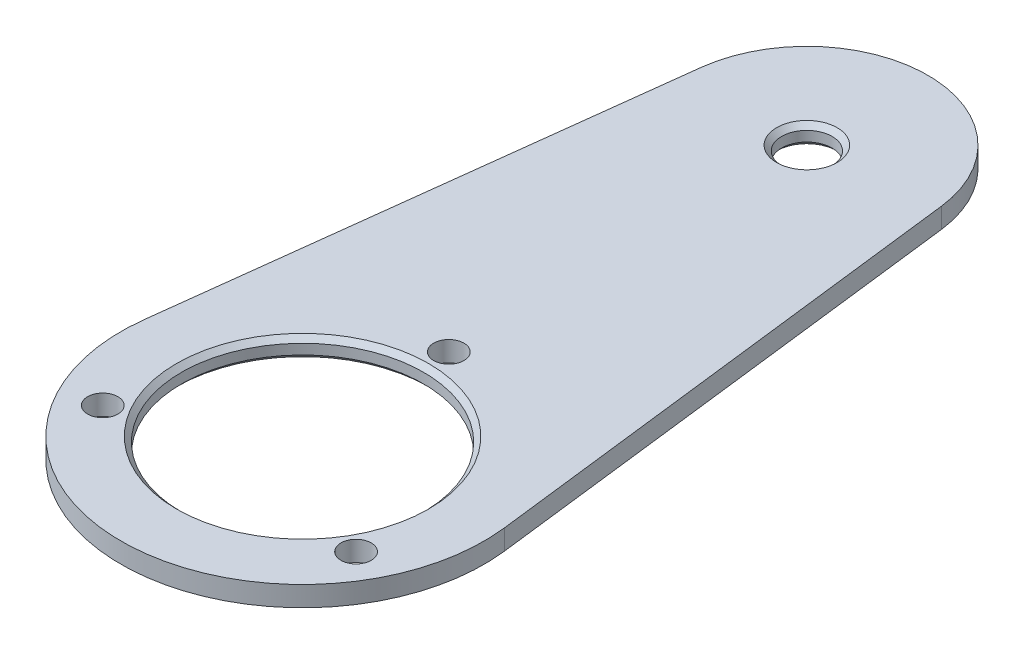
ISO-10303-21;
HEADER;
FILE_DESCRIPTION(('STEP AP214'),'2;1');
FILE_NAME('part.step','',(''),(''),'','','');
FILE_SCHEMA(('AUTOMOTIVE_DESIGN { 1 0 10303 214 1 1 1 1 }'));
ENDSEC;
DATA;
#1=APPLICATION_CONTEXT('core data for automotive mechanical design processes');
#2=APPLICATION_PROTOCOL_DEFINITION('international standard','automotive_design',2000,#1);
#3=PRODUCT_CONTEXT('',#1,'mechanical');
#4=PRODUCT('Part','Part','',(#3));
#5=PRODUCT_RELATED_PRODUCT_CATEGORY('part','',(#4));
#6=PRODUCT_DEFINITION_FORMATION('','',#4);
#7=PRODUCT_DEFINITION_CONTEXT('part definition',#1,'design');
#8=PRODUCT_DEFINITION('design','',#6,#7);
#9=PRODUCT_DEFINITION_SHAPE('','',#8);
#10=(LENGTH_UNIT() NAMED_UNIT(*) SI_UNIT(.MILLI.,.METRE.));
#11=(NAMED_UNIT(*) PLANE_ANGLE_UNIT() SI_UNIT($,.RADIAN.));
#12=(NAMED_UNIT(*) SI_UNIT($,.STERADIAN.) SOLID_ANGLE_UNIT());
#13=UNCERTAINTY_MEASURE_WITH_UNIT(LENGTH_MEASURE(1.E-05),#10,'distance_accuracy_value','');
#14=(GEOMETRIC_REPRESENTATION_CONTEXT(3) GLOBAL_UNCERTAINTY_ASSIGNED_CONTEXT((#13)) GLOBAL_UNIT_ASSIGNED_CONTEXT((#10,
#11,#12)) REPRESENTATION_CONTEXT('',''));
#15=CARTESIAN_POINT('',(0.,0.,0.));
#16=DIRECTION('',(0.,0.,1.));
#17=DIRECTION('',(1.,0.,0.));
#18=AXIS2_PLACEMENT_3D('',#15,#16,#17);
#19=CARTESIAN_POINT('',(0.,2.,0.));
#20=DIRECTION('',(0.,1.,0.));
#21=DIRECTION('',(0.,0.,1.));
#22=AXIS2_PLACEMENT_3D('',#19,#20,#21);
#23=PLANE('',#22);
#24=CARTESIAN_POINT('',(0.,2.,-50.));
#25=DIRECTION('',(0.,1.,0.));
#26=DIRECTION('',(0.,0.,1.));
#27=AXIS2_PLACEMENT_3D('',#24,#25,#26);
#28=CIRCLE('',#27,3.00000000000001);
#29=CARTESIAN_POINT('',(0.,2.,-47.));
#30=VERTEX_POINT('',#29);
#31=EDGE_CURVE('E124',#30,#30,#28,.F.);
#32=ORIENTED_EDGE('',*,*,#31,.T.);
#33=EDGE_LOOP('',(#32));
#34=FACE_BOUND('',#33,.T.);
#35=CARTESIAN_POINT('',(0.,2.,0.));
#36=DIRECTION('',(0.,1.,0.));
#37=DIRECTION('',(0.,0.,1.));
#38=AXIS2_PLACEMENT_3D('',#35,#36,#37);
#39=CIRCLE('',#38,12.5);
#40=CARTESIAN_POINT('',(0.,2.,12.5));
#41=VERTEX_POINT('',#40);
#42=EDGE_CURVE('E121',#41,#41,#39,.F.);
#43=ORIENTED_EDGE('',*,*,#42,.T.);
#44=EDGE_LOOP('',(#43));
#45=FACE_BOUND('',#44,.T.);
#46=CARTESIAN_POINT('',(12.5573683548743,2.,7.25000000000006));
#47=DIRECTION('',(0.,1.,0.));
#48=DIRECTION('',(0.,0.,1.));
#49=AXIS2_PLACEMENT_3D('',#46,#47,#48);
#50=CIRCLE('',#49,1.5);
#51=CARTESIAN_POINT('',(12.5573683548743,2.,8.75000000000006));
#52=VERTEX_POINT('',#51);
#53=EDGE_CURVE('E161',#52,#52,#50,.T.);
#54=ORIENTED_EDGE('',*,*,#53,.F.);
#55=EDGE_LOOP('',(#54));
#56=FACE_BOUND('',#55,.T.);
#57=CARTESIAN_POINT('',(0.,2.,0.));
#58=DIRECTION('',(0.,1.,0.));
#59=DIRECTION('',(0.,0.,1.));
#60=AXIS2_PLACEMENT_3D('',#57,#58,#59);
#61=CIRCLE('',#60,18.);
#62=CARTESIAN_POINT('',(-17.8699300502268,2.,-2.16));
#63=VERTEX_POINT('',#62);
#64=CARTESIAN_POINT('',(17.8699300502268,2.,-2.16));
#65=VERTEX_POINT('',#64);
#66=EDGE_CURVE('E84',#63,#65,#61,.T.);
#67=ORIENTED_EDGE('',*,*,#66,.T.);
#68=DIRECTION('',(-0.12,0.,-0.992773891679268));
#69=VECTOR('',#68,1.);
#70=CARTESIAN_POINT('',(11.9132867001512,2.,-51.44));
#71=LINE('',#70,#69);
#72=CARTESIAN_POINT('',(11.9132867001512,2.,-51.44));
#73=VERTEX_POINT('',#72);
#74=EDGE_CURVE('E79',#65,#73,#71,.T.);
#75=ORIENTED_EDGE('',*,*,#74,.T.);
#76=CARTESIAN_POINT('',(0.,2.,-50.));
#77=DIRECTION('',(0.,1.,0.));
#78=DIRECTION('',(0.,0.,-1.));
#79=AXIS2_PLACEMENT_3D('',#76,#77,#78);
#80=CIRCLE('',#79,12.);
#81=CARTESIAN_POINT('',(-11.9132867001512,2.,-51.44));
#82=VERTEX_POINT('',#81);
#83=EDGE_CURVE('E82',#73,#82,#80,.T.);
#84=ORIENTED_EDGE('',*,*,#83,.T.);
#85=DIRECTION('',(-0.12,0.,0.992773891679269));
#86=VECTOR('',#85,1.);
#87=CARTESIAN_POINT('',(-11.9132867001512,2.,-51.44));
#88=LINE('',#87,#86);
#89=EDGE_CURVE('E48',#82,#63,#88,.T.);
#90=ORIENTED_EDGE('',*,*,#89,.T.);
#91=EDGE_LOOP('',(#67,#75,#84,#90));
#92=FACE_BOUND('',#91,.T.);
#93=CARTESIAN_POINT('',(-12.5573683548744,2.,7.24999999999989));
#94=DIRECTION('',(0.,1.,0.));
#95=DIRECTION('',(0.,0.,1.));
#96=AXIS2_PLACEMENT_3D('',#93,#94,#95);
#97=CIRCLE('',#96,1.5);
#98=CARTESIAN_POINT('',(-12.5573683548744,2.,8.74999999999989));
#99=VERTEX_POINT('',#98);
#100=EDGE_CURVE('E102',#99,#99,#97,.T.);
#101=ORIENTED_EDGE('',*,*,#100,.F.);
#102=EDGE_LOOP('',(#101));
#103=FACE_BOUND('',#102,.T.);
#104=CARTESIAN_POINT('',(0.,2.,-14.5));
#105=DIRECTION('',(0.,1.,0.));
#106=DIRECTION('',(0.,0.,1.));
#107=AXIS2_PLACEMENT_3D('',#104,#105,#106);
#108=CIRCLE('',#107,1.5);
#109=CARTESIAN_POINT('',(0.,2.,-13.));
#110=VERTEX_POINT('',#109);
#111=EDGE_CURVE('E156',#110,#110,#108,.T.);
#112=ORIENTED_EDGE('',*,*,#111,.F.);
#113=EDGE_LOOP('',(#112));
#114=FACE_BOUND('',#113,.T.);
#115=ADVANCED_FACE('F31',(#34,#45,#56,#92,#103,#114),#23,.T.);
#116=CARTESIAN_POINT('',(0.,0.,0.));
#117=DIRECTION('',(0.,1.,0.));
#118=DIRECTION('',(0.,0.,1.));
#119=AXIS2_PLACEMENT_3D('',#116,#117,#118);
#120=PLANE('',#119);
#121=CARTESIAN_POINT('',(0.,0.,-50.));
#122=DIRECTION('',(0.,1.,0.));
#123=DIRECTION('',(0.,0.,1.));
#124=AXIS2_PLACEMENT_3D('',#121,#122,#123);
#125=CIRCLE('',#124,3.00000000000002);
#126=CARTESIAN_POINT('',(0.,0.,-47.));
#127=VERTEX_POINT('',#126);
#128=EDGE_CURVE('E112',#127,#127,#125,.T.);
#129=ORIENTED_EDGE('',*,*,#128,.T.);
#130=EDGE_LOOP('',(#129));
#131=FACE_BOUND('',#130,.T.);
#132=CARTESIAN_POINT('',(0.,0.,0.));
#133=DIRECTION('',(0.,1.,0.));
#134=DIRECTION('',(0.,0.,1.));
#135=AXIS2_PLACEMENT_3D('',#132,#133,#134);
#136=CIRCLE('',#135,12.5);
#137=CARTESIAN_POINT('',(0.,0.,12.5));
#138=VERTEX_POINT('',#137);
#139=EDGE_CURVE('E109',#138,#138,#136,.T.);
#140=ORIENTED_EDGE('',*,*,#139,.T.);
#141=EDGE_LOOP('',(#140));
#142=FACE_BOUND('',#141,.T.);
#143=CARTESIAN_POINT('',(12.5573683548743,0.,7.25000000000006));
#144=DIRECTION('',(0.,1.,0.));
#145=DIRECTION('',(0.,0.,1.));
#146=AXIS2_PLACEMENT_3D('',#143,#144,#145);
#147=CIRCLE('',#146,1.5);
#148=CARTESIAN_POINT('',(12.5573683548743,0.,8.75000000000006));
#149=VERTEX_POINT('',#148);
#150=EDGE_CURVE('E145',#149,#149,#147,.T.);
#151=ORIENTED_EDGE('',*,*,#150,.T.);
#152=EDGE_LOOP('',(#151));
#153=FACE_BOUND('',#152,.T.);
#154=CARTESIAN_POINT('',(0.,0.,0.));
#155=DIRECTION('',(0.,1.,0.));
#156=DIRECTION('',(0.,0.,1.));
#157=AXIS2_PLACEMENT_3D('',#154,#155,#156);
#158=CIRCLE('',#157,18.);
#159=CARTESIAN_POINT('',(-17.8699300502268,0.,-2.16));
#160=VERTEX_POINT('',#159);
#161=CARTESIAN_POINT('',(17.8699300502268,0.,-2.16));
#162=VERTEX_POINT('',#161);
#163=EDGE_CURVE('E99',#160,#162,#158,.T.);
#164=ORIENTED_EDGE('',*,*,#163,.F.);
#165=DIRECTION('',(-0.12,0.,0.992773891679269));
#166=VECTOR('',#165,1.);
#167=CARTESIAN_POINT('',(-11.9132867001512,0.,-51.44));
#168=LINE('',#167,#166);
#169=CARTESIAN_POINT('',(-11.9132867001512,0.,-51.44));
#170=VERTEX_POINT('',#169);
#171=EDGE_CURVE('E71',#170,#160,#168,.T.);
#172=ORIENTED_EDGE('',*,*,#171,.F.);
#173=CARTESIAN_POINT('',(0.,0.,-50.));
#174=DIRECTION('',(0.,1.,0.));
#175=DIRECTION('',(0.,0.,-1.));
#176=AXIS2_PLACEMENT_3D('',#173,#174,#175);
#177=CIRCLE('',#176,12.);
#178=CARTESIAN_POINT('',(11.9132867001512,0.,-51.44));
#179=VERTEX_POINT('',#178);
#180=EDGE_CURVE('E65',#179,#170,#177,.T.);
#181=ORIENTED_EDGE('',*,*,#180,.F.);
#182=DIRECTION('',(-0.12,0.,-0.992773891679268));
#183=VECTOR('',#182,1.);
#184=CARTESIAN_POINT('',(11.9132867001512,0.,-51.44));
#185=LINE('',#184,#183);
#186=EDGE_CURVE('E89',#162,#179,#185,.T.);
#187=ORIENTED_EDGE('',*,*,#186,.F.);
#188=EDGE_LOOP('',(#164,#172,#181,#187));
#189=FACE_BOUND('',#188,.T.);
#190=CARTESIAN_POINT('',(-12.5573683548744,0.,7.24999999999989));
#191=DIRECTION('',(0.,1.,0.));
#192=DIRECTION('',(0.,0.,1.));
#193=AXIS2_PLACEMENT_3D('',#190,#191,#192);
#194=CIRCLE('',#193,1.5);
#195=CARTESIAN_POINT('',(-12.5573683548744,0.,8.74999999999989));
#196=VERTEX_POINT('',#195);
#197=EDGE_CURVE('E151',#196,#196,#194,.T.);
#198=ORIENTED_EDGE('',*,*,#197,.T.);
#199=EDGE_LOOP('',(#198));
#200=FACE_BOUND('',#199,.T.);
#201=CARTESIAN_POINT('',(0.,0.,-14.5));
#202=DIRECTION('',(0.,1.,0.));
#203=DIRECTION('',(0.,0.,1.));
#204=AXIS2_PLACEMENT_3D('',#201,#202,#203);
#205=CIRCLE('',#204,1.5);
#206=CARTESIAN_POINT('',(0.,0.,-13.));
#207=VERTEX_POINT('',#206);
#208=EDGE_CURVE('E154',#207,#207,#205,.T.);
#209=ORIENTED_EDGE('',*,*,#208,.T.);
#210=EDGE_LOOP('',(#209));
#211=FACE_BOUND('',#210,.T.);
#212=ADVANCED_FACE('F136',(#131,#142,#153,#189,#200,#211),#120,.F.);
#213=CARTESIAN_POINT('',(0.,2.,0.));
#214=DIRECTION('',(0.,-1.,0.));
#215=DIRECTION('',(0.,0.,-1.));
#216=AXIS2_PLACEMENT_3D('',#213,#214,#215);
#217=CYLINDRICAL_SURFACE('',#216,18.);
#218=ORIENTED_EDGE('',*,*,#163,.T.);
#219=DIRECTION('',(0.,-1.,0.));
#220=VECTOR('',#219,1.);
#221=CARTESIAN_POINT('',(17.8699300502268,2.,-2.16));
#222=LINE('',#221,#220);
#223=EDGE_CURVE('E90',#65,#162,#222,.T.);
#224=ORIENTED_EDGE('',*,*,#223,.F.);
#225=ORIENTED_EDGE('',*,*,#66,.F.);
#226=DIRECTION('',(0.,-1.,0.));
#227=VECTOR('',#226,1.);
#228=CARTESIAN_POINT('',(-17.8699300502268,2.,-2.16));
#229=LINE('',#228,#227);
#230=EDGE_CURVE('E95',#63,#160,#229,.T.);
#231=ORIENTED_EDGE('',*,*,#230,.T.);
#232=EDGE_LOOP('',(#218,#224,#225,#231));
#233=FACE_BOUND('',#232,.T.);
#234=ADVANCED_FACE('F139',(#233),#217,.T.);
#235=CARTESIAN_POINT('',(11.9132867001512,2.,-51.44));
#236=DIRECTION('',(-0.992773891679269,0.,0.12));
#237=DIRECTION('',(0.12,0.,0.992773891679269));
#238=AXIS2_PLACEMENT_3D('',#235,#236,#237);
#239=PLANE('',#238);
#240=ORIENTED_EDGE('',*,*,#186,.T.);
#241=DIRECTION('',(0.,-1.,0.));
#242=VECTOR('',#241,1.);
#243=CARTESIAN_POINT('',(11.9132867001512,2.,-51.44));
#244=LINE('',#243,#242);
#245=EDGE_CURVE('E87',#73,#179,#244,.T.);
#246=ORIENTED_EDGE('',*,*,#245,.F.);
#247=ORIENTED_EDGE('',*,*,#74,.F.);
#248=ORIENTED_EDGE('',*,*,#223,.T.);
#249=EDGE_LOOP('',(#240,#246,#247,#248));
#250=FACE_BOUND('',#249,.T.);
#251=ADVANCED_FACE('F88',(#250),#239,.F.);
#252=CARTESIAN_POINT('',(0.,2.,-50.));
#253=DIRECTION('',(0.,-1.,0.));
#254=DIRECTION('',(0.,0.,-1.));
#255=AXIS2_PLACEMENT_3D('',#252,#253,#254);
#256=CYLINDRICAL_SURFACE('',#255,12.);
#257=ORIENTED_EDGE('',*,*,#180,.T.);
#258=DIRECTION('',(0.,-1.,0.));
#259=VECTOR('',#258,1.);
#260=CARTESIAN_POINT('',(-11.9132867001512,2.,-51.44));
#261=LINE('',#260,#259);
#262=EDGE_CURVE('E91',#82,#170,#261,.T.);
#263=ORIENTED_EDGE('',*,*,#262,.F.);
#264=ORIENTED_EDGE('',*,*,#83,.F.);
#265=ORIENTED_EDGE('',*,*,#245,.T.);
#266=EDGE_LOOP('',(#257,#263,#264,#265));
#267=FACE_BOUND('',#266,.T.);
#268=ADVANCED_FACE('F93',(#267),#256,.T.);
#269=CARTESIAN_POINT('',(-11.9132867001512,2.,-51.44));
#270=DIRECTION('',(0.992773891679269,0.,0.12));
#271=DIRECTION('',(0.12,0.,-0.992773891679269));
#272=AXIS2_PLACEMENT_3D('',#269,#270,#271);
#273=PLANE('',#272);
#274=ORIENTED_EDGE('',*,*,#171,.T.);
#275=ORIENTED_EDGE('',*,*,#230,.F.);
#276=ORIENTED_EDGE('',*,*,#89,.F.);
#277=ORIENTED_EDGE('',*,*,#262,.T.);
#278=EDGE_LOOP('',(#274,#275,#276,#277));
#279=FACE_BOUND('',#278,.T.);
#280=ADVANCED_FACE('F199',(#279),#273,.F.);
#281=CARTESIAN_POINT('',(0.,2.,0.));
#282=DIRECTION('',(0.,-1.,0.));
#283=DIRECTION('',(0.,0.,-1.));
#284=AXIS2_PLACEMENT_3D('',#281,#282,#283);
#285=CYLINDRICAL_SURFACE('',#284,12.);
#286=CARTESIAN_POINT('',(0.,1.5,0.));
#287=DIRECTION('',(0.,1.,0.));
#288=DIRECTION('',(0.,0.,1.));
#289=AXIS2_PLACEMENT_3D('',#286,#287,#288);
#290=CIRCLE('',#289,12.);
#291=CARTESIAN_POINT('',(0.,1.5,12.));
#292=VERTEX_POINT('',#291);
#293=EDGE_CURVE('E11',#292,#292,#290,.T.);
#294=ORIENTED_EDGE('',*,*,#293,.T.);
#295=EDGE_LOOP('',(#294));
#296=FACE_BOUND('',#295,.T.);
#297=CARTESIAN_POINT('',(0.,0.500000000000002,0.));
#298=DIRECTION('',(0.,1.,0.));
#299=DIRECTION('',(0.,0.,1.));
#300=AXIS2_PLACEMENT_3D('',#297,#298,#299);
#301=CIRCLE('',#300,12.);
#302=CARTESIAN_POINT('',(0.,0.500000000000002,12.));
#303=VERTEX_POINT('',#302);
#304=EDGE_CURVE('E40',#303,#303,#301,.F.);
#305=ORIENTED_EDGE('',*,*,#304,.T.);
#306=EDGE_LOOP('',(#305));
#307=FACE_BOUND('',#306,.T.);
#308=ADVANCED_FACE('F129',(#296,#307),#285,.F.);
#309=CARTESIAN_POINT('',(0.,2.,-50.));
#310=DIRECTION('',(0.,-1.,0.));
#311=DIRECTION('',(0.,0.,-1.));
#312=AXIS2_PLACEMENT_3D('',#309,#310,#311);
#313=CYLINDRICAL_SURFACE('',#312,2.5);
#314=CARTESIAN_POINT('',(0.,0.50000000000001,-50.));
#315=DIRECTION('',(0.,1.,0.));
#316=DIRECTION('',(0.,0.,1.));
#317=AXIS2_PLACEMENT_3D('',#314,#315,#316);
#318=CIRCLE('',#317,2.5);
#319=CARTESIAN_POINT('',(0.,0.50000000000001,-47.5));
#320=VERTEX_POINT('',#319);
#321=EDGE_CURVE('E118',#320,#320,#318,.F.);
#322=ORIENTED_EDGE('',*,*,#321,.T.);
#323=EDGE_LOOP('',(#322));
#324=FACE_BOUND('',#323,.T.);
#325=CARTESIAN_POINT('',(0.,1.49999999999999,-50.));
#326=DIRECTION('',(0.,1.,0.));
#327=DIRECTION('',(0.,0.,1.));
#328=AXIS2_PLACEMENT_3D('',#325,#326,#327);
#329=CIRCLE('',#328,2.5);
#330=CARTESIAN_POINT('',(0.,1.49999999999999,-47.5));
#331=VERTEX_POINT('',#330);
#332=EDGE_CURVE('E115',#331,#331,#329,.T.);
#333=ORIENTED_EDGE('',*,*,#332,.T.);
#334=EDGE_LOOP('',(#333));
#335=FACE_BOUND('',#334,.T.);
#336=ADVANCED_FACE('F194',(#324,#335),#313,.F.);
#337=CARTESIAN_POINT('',(-12.5573683548744,2.,7.24999999999989));
#338=DIRECTION('',(0.,-1.,0.));
#339=DIRECTION('',(0.,0.,-1.));
#340=AXIS2_PLACEMENT_3D('',#337,#338,#339);
#341=CYLINDRICAL_SURFACE('',#340,1.5);
#342=ORIENTED_EDGE('',*,*,#100,.T.);
#343=EDGE_LOOP('',(#342));
#344=FACE_BOUND('',#343,.T.);
#345=ORIENTED_EDGE('',*,*,#197,.F.);
#346=EDGE_LOOP('',(#345));
#347=FACE_BOUND('',#346,.T.);
#348=ADVANCED_FACE('F169',(#344,#347),#341,.F.);
#349=CARTESIAN_POINT('',(12.5573683548743,2.,7.25000000000006));
#350=DIRECTION('',(0.,-1.,0.));
#351=DIRECTION('',(0.,0.,-1.));
#352=AXIS2_PLACEMENT_3D('',#349,#350,#351);
#353=CYLINDRICAL_SURFACE('',#352,1.5);
#354=ORIENTED_EDGE('',*,*,#53,.T.);
#355=EDGE_LOOP('',(#354));
#356=FACE_BOUND('',#355,.T.);
#357=ORIENTED_EDGE('',*,*,#150,.F.);
#358=EDGE_LOOP('',(#357));
#359=FACE_BOUND('',#358,.T.);
#360=ADVANCED_FACE('F180',(#356,#359),#353,.F.);
#361=CARTESIAN_POINT('',(0.,2.,-14.5));
#362=DIRECTION('',(0.,-1.,0.));
#363=DIRECTION('',(0.,0.,-1.));
#364=AXIS2_PLACEMENT_3D('',#361,#362,#363);
#365=CYLINDRICAL_SURFACE('',#364,1.5);
#366=ORIENTED_EDGE('',*,*,#111,.T.);
#367=EDGE_LOOP('',(#366));
#368=FACE_BOUND('',#367,.T.);
#369=ORIENTED_EDGE('',*,*,#208,.F.);
#370=EDGE_LOOP('',(#369));
#371=FACE_BOUND('',#370,.T.);
#372=ADVANCED_FACE('F177',(#368,#371),#365,.F.);
#373=CARTESIAN_POINT('',(0.,0.,-50.));
#374=DIRECTION('',(0.,-1.,0.));
#375=DIRECTION('',(0.,0.,-1.));
#376=AXIS2_PLACEMENT_3D('',#373,#374,#375);
#377=CONICAL_SURFACE('',#376,3.00000000000002,0.78539816339746);
#378=ORIENTED_EDGE('',*,*,#321,.F.);
#379=EDGE_LOOP('',(#378));
#380=FACE_BOUND('',#379,.T.);
#381=ORIENTED_EDGE('',*,*,#128,.F.);
#382=EDGE_LOOP('',(#381));
#383=FACE_BOUND('',#382,.T.);
#384=ADVANCED_FACE('F179',(#380,#383),#377,.F.);
#385=CARTESIAN_POINT('',(0.,1.49999999999999,-50.));
#386=DIRECTION('',(0.,1.,0.));
#387=DIRECTION('',(0.,0.,1.));
#388=AXIS2_PLACEMENT_3D('',#385,#386,#387);
#389=CONICAL_SURFACE('',#388,2.5,0.785398163397447);
#390=ORIENTED_EDGE('',*,*,#31,.F.);
#391=EDGE_LOOP('',(#390));
#392=FACE_BOUND('',#391,.T.);
#393=ORIENTED_EDGE('',*,*,#332,.F.);
#394=EDGE_LOOP('',(#393));
#395=FACE_BOUND('',#394,.T.);
#396=ADVANCED_FACE('F186',(#392,#395),#389,.F.);
#397=CARTESIAN_POINT('',(0.,1.5,0.));
#398=DIRECTION('',(0.,1.,0.));
#399=DIRECTION('',(0.,0.,1.));
#400=AXIS2_PLACEMENT_3D('',#397,#398,#399);
#401=CONICAL_SURFACE('',#400,12.,0.785398163397457);
#402=ORIENTED_EDGE('',*,*,#42,.F.);
#403=EDGE_LOOP('',(#402));
#404=FACE_BOUND('',#403,.T.);
#405=ORIENTED_EDGE('',*,*,#293,.F.);
#406=EDGE_LOOP('',(#405));
#407=FACE_BOUND('',#406,.T.);
#408=ADVANCED_FACE('F133',(#404,#407),#401,.F.);
#409=CARTESIAN_POINT('',(0.,0.,0.));
#410=DIRECTION('',(0.,-1.,0.));
#411=DIRECTION('',(0.,0.,-1.));
#412=AXIS2_PLACEMENT_3D('',#409,#410,#411);
#413=CONICAL_SURFACE('',#412,12.5,0.785398163397441);
#414=ORIENTED_EDGE('',*,*,#304,.F.);
#415=EDGE_LOOP('',(#414));
#416=FACE_BOUND('',#415,.T.);
#417=ORIENTED_EDGE('',*,*,#139,.F.);
#418=EDGE_LOOP('',(#417));
#419=FACE_BOUND('',#418,.T.);
#420=ADVANCED_FACE('F33',(#416,#419),#413,.F.);
#421=CLOSED_SHELL('',(#115,#212,#234,#251,#268,#280,#308,#336,#348,#360,#372,#384,#396,#408,#420));
#422=MANIFOLD_SOLID_BREP('B2',#421);
#423=ADVANCED_BREP_SHAPE_REPRESENTATION('',(#18,#422),#14);
#424=SHAPE_DEFINITION_REPRESENTATION(#9,#423);
ENDSEC;
END-ISO-10303-21;
